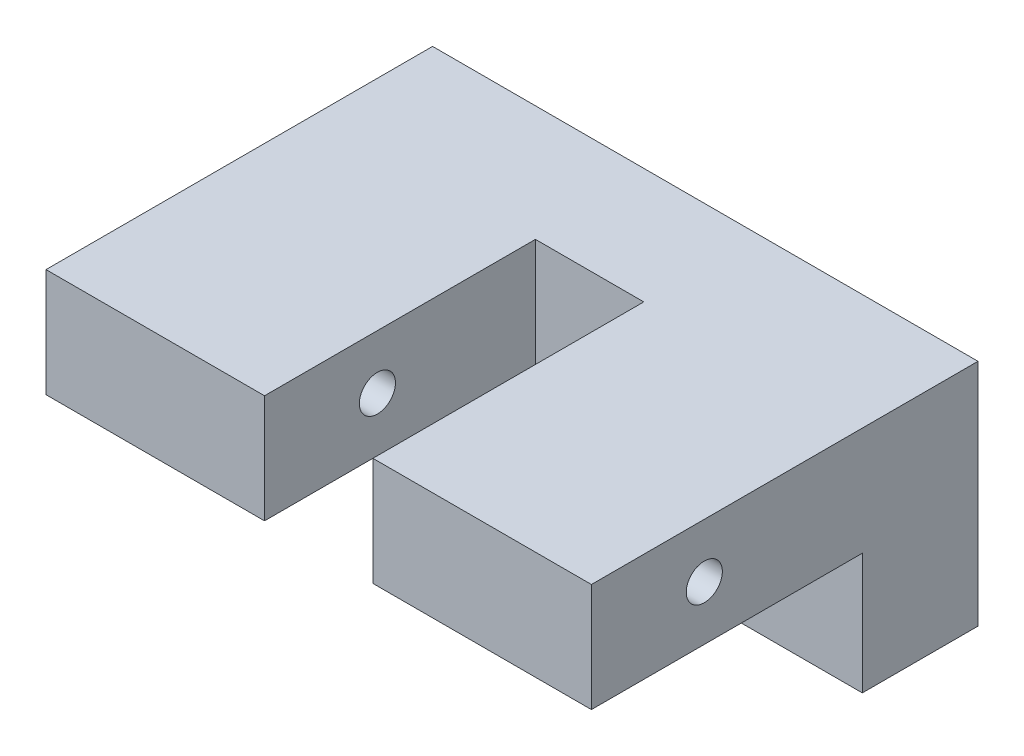
ISO-10303-21;
HEADER;
FILE_DESCRIPTION(('STEP AP214'),'2;1');
FILE_NAME('part.step','',(''),(''),'','','');
FILE_SCHEMA(('AUTOMOTIVE_DESIGN { 1 0 10303 214 1 1 1 1 }'));
ENDSEC;
DATA;
#1=APPLICATION_CONTEXT('core data for automotive mechanical design processes');
#2=APPLICATION_PROTOCOL_DEFINITION('international standard','automotive_design',2000,#1);
#3=PRODUCT_CONTEXT('',#1,'mechanical');
#4=PRODUCT('Part','Part','',(#3));
#5=PRODUCT_RELATED_PRODUCT_CATEGORY('part','',(#4));
#6=PRODUCT_DEFINITION_FORMATION('','',#4);
#7=PRODUCT_DEFINITION_CONTEXT('part definition',#1,'design');
#8=PRODUCT_DEFINITION('design','',#6,#7);
#9=PRODUCT_DEFINITION_SHAPE('','',#8);
#10=(LENGTH_UNIT() NAMED_UNIT(*) SI_UNIT(.MILLI.,.METRE.));
#11=(NAMED_UNIT(*) PLANE_ANGLE_UNIT() SI_UNIT($,.RADIAN.));
#12=(NAMED_UNIT(*) SI_UNIT($,.STERADIAN.) SOLID_ANGLE_UNIT());
#13=UNCERTAINTY_MEASURE_WITH_UNIT(LENGTH_MEASURE(1.E-05),#10,'distance_accuracy_value','');
#14=(GEOMETRIC_REPRESENTATION_CONTEXT(3) GLOBAL_UNCERTAINTY_ASSIGNED_CONTEXT((#13)) GLOBAL_UNIT_ASSIGNED_CONTEXT((#10,
#11,#12)) REPRESENTATION_CONTEXT('',''));
#15=CARTESIAN_POINT('',(0.,0.,0.));
#16=DIRECTION('',(0.,0.,1.));
#17=DIRECTION('',(1.,0.,0.));
#18=AXIS2_PLACEMENT_3D('',#15,#16,#17);
#19=CARTESIAN_POINT('',(0.,0.,85.62));
#20=DIRECTION('',(0.,0.,-1.));
#21=DIRECTION('',(-1.,0.,0.));
#22=AXIS2_PLACEMENT_3D('',#19,#20,#21);
#23=PLANE('',#22);
#24=DIRECTION('',(0.,-1.,0.));
#25=VECTOR('',#24,1.);
#26=CARTESIAN_POINT('',(0.,0.,85.62));
#27=LINE('',#26,#25);
#28=CARTESIAN_POINT('',(0.,50.8,85.62));
#29=VERTEX_POINT('',#28);
#30=CARTESIAN_POINT('',(0.,26.8,85.62));
#31=VERTEX_POINT('',#30);
#32=EDGE_CURVE('E101',#29,#31,#27,.T.);
#33=ORIENTED_EDGE('',*,*,#32,.T.);
#34=DIRECTION('',(1.,0.,0.));
#35=VECTOR('',#34,1.);
#36=CARTESIAN_POINT('',(0.,26.8,85.62));
#37=LINE('',#36,#35);
#38=CARTESIAN_POINT('',(48.4,26.8,85.62));
#39=VERTEX_POINT('',#38);
#40=EDGE_CURVE('E191',#31,#39,#37,.T.);
#41=ORIENTED_EDGE('',*,*,#40,.T.);
#42=DIRECTION('',(0.,-1.,0.));
#43=VECTOR('',#42,1.);
#44=CARTESIAN_POINT('',(48.4,50.8,85.62));
#45=LINE('',#44,#43);
#46=CARTESIAN_POINT('',(48.4,50.8,85.62));
#47=VERTEX_POINT('',#46);
#48=EDGE_CURVE('E185',#47,#39,#45,.T.);
#49=ORIENTED_EDGE('',*,*,#48,.F.);
#50=DIRECTION('',(-1.,0.,0.));
#51=VECTOR('',#50,1.);
#52=CARTESIAN_POINT('',(0.,50.8,85.62));
#53=LINE('',#52,#51);
#54=EDGE_CURVE('E70',#47,#29,#53,.T.);
#55=ORIENTED_EDGE('',*,*,#54,.T.);
#56=EDGE_LOOP('',(#33,#41,#49,#55));
#57=FACE_BOUND('',#56,.T.);
#58=ADVANCED_FACE('F44',(#57),#23,.F.);
#59=CARTESIAN_POINT('',(0.,0.,85.62));
#60=DIRECTION('',(1.,0.,0.));
#61=DIRECTION('',(0.,0.,-1.));
#62=AXIS2_PLACEMENT_3D('',#59,#60,#61);
#63=PLANE('',#62);
#64=CARTESIAN_POINT('',(0.,38.8,60.62));
#65=DIRECTION('',(1.,0.,0.));
#66=DIRECTION('',(0.,0.,-1.));
#67=AXIS2_PLACEMENT_3D('',#64,#65,#66);
#68=CIRCLE('',#67,4.00000000000001);
#69=CARTESIAN_POINT('',(0.,38.8,56.62));
#70=VERTEX_POINT('',#69);
#71=EDGE_CURVE('E228',#70,#70,#68,.T.);
#72=ORIENTED_EDGE('',*,*,#71,.T.);
#73=EDGE_LOOP('',(#72));
#74=FACE_BOUND('',#73,.T.);
#75=DIRECTION('',(0.,1.,0.));
#76=VECTOR('',#75,1.);
#77=CARTESIAN_POINT('',(0.,0.,25.62));
#78=LINE('',#77,#76);
#79=CARTESIAN_POINT('',(0.,0.,25.62));
#80=VERTEX_POINT('',#79);
#81=CARTESIAN_POINT('',(0.,26.8,25.62));
#82=VERTEX_POINT('',#81);
#83=EDGE_CURVE('E150',#80,#82,#78,.T.);
#84=ORIENTED_EDGE('',*,*,#83,.T.);
#85=DIRECTION('',(0.,0.,1.));
#86=VECTOR('',#85,1.);
#87=CARTESIAN_POINT('',(0.,26.8,85.62));
#88=LINE('',#87,#86);
#89=EDGE_CURVE('E250',#82,#31,#88,.T.);
#90=ORIENTED_EDGE('',*,*,#89,.T.);
#91=ORIENTED_EDGE('',*,*,#32,.F.);
#92=DIRECTION('',(0.,0.,-1.));
#93=VECTOR('',#92,1.);
#94=CARTESIAN_POINT('',(0.,50.8,85.62));
#95=LINE('',#94,#93);
#96=CARTESIAN_POINT('',(0.,50.8,0.));
#97=VERTEX_POINT('',#96);
#98=EDGE_CURVE('E92',#29,#97,#95,.T.);
#99=ORIENTED_EDGE('',*,*,#98,.T.);
#100=DIRECTION('',(0.,-1.,0.));
#101=VECTOR('',#100,1.);
#102=CARTESIAN_POINT('',(0.,0.,0.));
#103=LINE('',#102,#101);
#104=CARTESIAN_POINT('',(0.,0.,0.));
#105=VERTEX_POINT('',#104);
#106=EDGE_CURVE('E108',#97,#105,#103,.T.);
#107=ORIENTED_EDGE('',*,*,#106,.T.);
#108=DIRECTION('',(0.,0.,-1.));
#109=VECTOR('',#108,1.);
#110=CARTESIAN_POINT('',(0.,0.,85.62));
#111=LINE('',#110,#109);
#112=EDGE_CURVE('E11',#80,#105,#111,.T.);
#113=ORIENTED_EDGE('',*,*,#112,.F.);
#114=EDGE_LOOP('',(#84,#90,#91,#99,#107,#113));
#115=FACE_BOUND('',#114,.T.);
#116=ADVANCED_FACE('F46',(#74,#115),#63,.F.);
#117=CARTESIAN_POINT('',(0.,0.,85.62));
#118=DIRECTION('',(0.,1.,0.));
#119=DIRECTION('',(0.,0.,1.));
#120=AXIS2_PLACEMENT_3D('',#117,#118,#119);
#121=PLANE('',#120);
#122=DIRECTION('',(0.,0.,-1.));
#123=VECTOR('',#122,1.);
#124=CARTESIAN_POINT('',(120.8,0.,85.62));
#125=LINE('',#124,#123);
#126=CARTESIAN_POINT('',(120.8,0.,25.62));
#127=VERTEX_POINT('',#126);
#128=CARTESIAN_POINT('',(120.8,0.,0.));
#129=VERTEX_POINT('',#128);
#130=EDGE_CURVE('E54',#127,#129,#125,.T.);
#131=ORIENTED_EDGE('',*,*,#130,.F.);
#132=DIRECTION('',(1.,0.,0.));
#133=VECTOR('',#132,1.);
#134=CARTESIAN_POINT('',(48.4,0.,25.62));
#135=LINE('',#134,#133);
#136=EDGE_CURVE('E147',#80,#127,#135,.T.);
#137=ORIENTED_EDGE('',*,*,#136,.F.);
#138=ORIENTED_EDGE('',*,*,#112,.T.);
#139=DIRECTION('',(1.,0.,0.));
#140=VECTOR('',#139,1.);
#141=CARTESIAN_POINT('',(0.,0.,0.));
#142=LINE('',#141,#140);
#143=EDGE_CURVE('E116',#105,#129,#142,.T.);
#144=ORIENTED_EDGE('',*,*,#143,.T.);
#145=EDGE_LOOP('',(#131,#137,#138,#144));
#146=FACE_BOUND('',#145,.T.);
#147=ADVANCED_FACE('F144',(#146),#121,.F.);
#148=CARTESIAN_POINT('',(120.8,0.,85.62));
#149=DIRECTION('',(-1.,0.,0.));
#150=DIRECTION('',(0.,0.,1.));
#151=AXIS2_PLACEMENT_3D('',#148,#149,#150);
#152=PLANE('',#151);
#153=CARTESIAN_POINT('',(120.8,38.8,60.62));
#154=DIRECTION('',(1.,0.,0.));
#155=DIRECTION('',(0.,0.,-1.));
#156=AXIS2_PLACEMENT_3D('',#153,#154,#155);
#157=CIRCLE('',#156,4.00000000000001);
#158=CARTESIAN_POINT('',(120.8,38.8,56.62));
#159=VERTEX_POINT('',#158);
#160=EDGE_CURVE('E224',#159,#159,#157,.T.);
#161=ORIENTED_EDGE('',*,*,#160,.F.);
#162=EDGE_LOOP('',(#161));
#163=FACE_BOUND('',#162,.T.);
#164=DIRECTION('',(0.,1.,0.));
#165=VECTOR('',#164,1.);
#166=CARTESIAN_POINT('',(120.8,0.,85.62));
#167=LINE('',#166,#165);
#168=CARTESIAN_POINT('',(120.8,26.8,85.62));
#169=VERTEX_POINT('',#168);
#170=CARTESIAN_POINT('',(120.8,50.8,85.62));
#171=VERTEX_POINT('',#170);
#172=EDGE_CURVE('E197',#169,#171,#167,.T.);
#173=ORIENTED_EDGE('',*,*,#172,.F.);
#174=DIRECTION('',(0.,0.,1.));
#175=VECTOR('',#174,1.);
#176=CARTESIAN_POINT('',(120.8,26.8,85.62));
#177=LINE('',#176,#175);
#178=CARTESIAN_POINT('',(120.8,26.8,25.62));
#179=VERTEX_POINT('',#178);
#180=EDGE_CURVE('E245',#179,#169,#177,.T.);
#181=ORIENTED_EDGE('',*,*,#180,.F.);
#182=DIRECTION('',(0.,1.,0.));
#183=VECTOR('',#182,1.);
#184=CARTESIAN_POINT('',(120.8,0.,25.62));
#185=LINE('',#184,#183);
#186=EDGE_CURVE('E141',#127,#179,#185,.T.);
#187=ORIENTED_EDGE('',*,*,#186,.F.);
#188=ORIENTED_EDGE('',*,*,#130,.T.);
#189=DIRECTION('',(0.,1.,0.));
#190=VECTOR('',#189,1.);
#191=CARTESIAN_POINT('',(120.8,0.,0.));
#192=LINE('',#191,#190);
#193=CARTESIAN_POINT('',(120.8,50.8,0.));
#194=VERTEX_POINT('',#193);
#195=EDGE_CURVE('E102',#129,#194,#192,.T.);
#196=ORIENTED_EDGE('',*,*,#195,.T.);
#197=DIRECTION('',(0.,0.,-1.));
#198=VECTOR('',#197,1.);
#199=CARTESIAN_POINT('',(120.8,50.8,85.62));
#200=LINE('',#199,#198);
#201=EDGE_CURVE('E96',#171,#194,#200,.T.);
#202=ORIENTED_EDGE('',*,*,#201,.F.);
#203=EDGE_LOOP('',(#173,#181,#187,#188,#196,#202));
#204=FACE_BOUND('',#203,.T.);
#205=ADVANCED_FACE('F138',(#163,#204),#152,.F.);
#206=CARTESIAN_POINT('',(0.,50.8,85.62));
#207=DIRECTION('',(0.,-1.,0.));
#208=DIRECTION('',(0.,0.,-1.));
#209=AXIS2_PLACEMENT_3D('',#206,#207,#208);
#210=PLANE('',#209);
#211=ORIENTED_EDGE('',*,*,#54,.F.);
#212=DIRECTION('',(0.,0.,1.));
#213=VECTOR('',#212,1.);
#214=CARTESIAN_POINT('',(48.4,50.8,25.62));
#215=LINE('',#214,#213);
#216=CARTESIAN_POINT('',(48.4,50.8,25.62));
#217=VERTEX_POINT('',#216);
#218=EDGE_CURVE('E118',#217,#47,#215,.T.);
#219=ORIENTED_EDGE('',*,*,#218,.F.);
#220=DIRECTION('',(-1.,0.,0.));
#221=VECTOR('',#220,1.);
#222=CARTESIAN_POINT('',(48.4,50.8,25.62));
#223=LINE('',#222,#221);
#224=CARTESIAN_POINT('',(72.4,50.8,25.62));
#225=VERTEX_POINT('',#224);
#226=EDGE_CURVE('E208',#225,#217,#223,.T.);
#227=ORIENTED_EDGE('',*,*,#226,.F.);
#228=DIRECTION('',(0.,0.,1.));
#229=VECTOR('',#228,1.);
#230=CARTESIAN_POINT('',(72.4,50.8,25.62));
#231=LINE('',#230,#229);
#232=CARTESIAN_POINT('',(72.4,50.8,85.62));
#233=VERTEX_POINT('',#232);
#234=EDGE_CURVE('E124',#225,#233,#231,.T.);
#235=ORIENTED_EDGE('',*,*,#234,.T.);
#236=EDGE_CURVE('E111',#171,#233,#53,.T.);
#237=ORIENTED_EDGE('',*,*,#236,.F.);
#238=ORIENTED_EDGE('',*,*,#201,.T.);
#239=DIRECTION('',(-1.,0.,0.));
#240=VECTOR('',#239,1.);
#241=CARTESIAN_POINT('',(0.,50.8,0.));
#242=LINE('',#241,#240);
#243=EDGE_CURVE('E89',#194,#97,#242,.T.);
#244=ORIENTED_EDGE('',*,*,#243,.T.);
#245=ORIENTED_EDGE('',*,*,#98,.F.);
#246=EDGE_LOOP('',(#211,#219,#227,#235,#237,#238,#244,#245));
#247=FACE_BOUND('',#246,.T.);
#248=ADVANCED_FACE('F91',(#247),#210,.F.);
#249=DIRECTION('',(0.,1.,0.));
#250=VECTOR('',#249,1.);
#251=CARTESIAN_POINT('',(72.4,50.8,85.62));
#252=LINE('',#251,#250);
#253=CARTESIAN_POINT('',(72.4,26.8,85.62));
#254=VERTEX_POINT('',#253);
#255=EDGE_CURVE('E193',#254,#233,#252,.T.);
#256=ORIENTED_EDGE('',*,*,#255,.F.);
#257=EDGE_CURVE('E242',#254,#169,#37,.T.);
#258=ORIENTED_EDGE('',*,*,#257,.T.);
#259=ORIENTED_EDGE('',*,*,#172,.T.);
#260=ORIENTED_EDGE('',*,*,#236,.T.);
#261=EDGE_LOOP('',(#256,#258,#259,#260));
#262=FACE_BOUND('',#261,.T.);
#263=ADVANCED_FACE('F280',(#262),#23,.F.);
#264=CARTESIAN_POINT('',(0.,0.,0.));
#265=DIRECTION('',(0.,0.,-1.));
#266=DIRECTION('',(-1.,0.,0.));
#267=AXIS2_PLACEMENT_3D('',#264,#265,#266);
#268=PLANE('',#267);
#269=ORIENTED_EDGE('',*,*,#106,.F.);
#270=ORIENTED_EDGE('',*,*,#243,.F.);
#271=ORIENTED_EDGE('',*,*,#195,.F.);
#272=ORIENTED_EDGE('',*,*,#143,.F.);
#273=EDGE_LOOP('',(#269,#270,#271,#272));
#274=FACE_BOUND('',#273,.T.);
#275=ADVANCED_FACE('F114',(#274),#268,.T.);
#276=CARTESIAN_POINT('',(48.4,50.8,25.62));
#277=DIRECTION('',(-1.,0.,0.));
#278=DIRECTION('',(0.,-1.,0.));
#279=AXIS2_PLACEMENT_3D('',#276,#277,#278);
#280=PLANE('',#279);
#281=CARTESIAN_POINT('',(48.4,38.8,60.62));
#282=DIRECTION('',(-1.,0.,0.));
#283=DIRECTION('',(0.,-1.,0.));
#284=AXIS2_PLACEMENT_3D('',#281,#282,#283);
#285=CIRCLE('',#284,4.00000000000001);
#286=CARTESIAN_POINT('',(48.4,34.8,60.62));
#287=VERTEX_POINT('',#286);
#288=EDGE_CURVE('E194',#287,#287,#285,.T.);
#289=ORIENTED_EDGE('',*,*,#288,.T.);
#290=EDGE_LOOP('',(#289));
#291=FACE_BOUND('',#290,.T.);
#292=ORIENTED_EDGE('',*,*,#48,.T.);
#293=DIRECTION('',(0.,0.,-1.));
#294=VECTOR('',#293,1.);
#295=CARTESIAN_POINT('',(48.4,26.8,25.62));
#296=LINE('',#295,#294);
#297=CARTESIAN_POINT('',(48.4,26.8,25.62));
#298=VERTEX_POINT('',#297);
#299=EDGE_CURVE('E229',#39,#298,#296,.T.);
#300=ORIENTED_EDGE('',*,*,#299,.T.);
#301=DIRECTION('',(0.,-1.,0.));
#302=VECTOR('',#301,1.);
#303=CARTESIAN_POINT('',(48.4,50.8,25.62));
#304=LINE('',#303,#302);
#305=EDGE_CURVE('E187',#217,#298,#304,.T.);
#306=ORIENTED_EDGE('',*,*,#305,.F.);
#307=ORIENTED_EDGE('',*,*,#218,.T.);
#308=EDGE_LOOP('',(#292,#300,#306,#307));
#309=FACE_BOUND('',#308,.T.);
#310=ADVANCED_FACE('F183',(#291,#309),#280,.F.);
#311=CARTESIAN_POINT('',(72.4,50.8,25.62));
#312=DIRECTION('',(1.,0.,0.));
#313=DIRECTION('',(0.,1.,0.));
#314=AXIS2_PLACEMENT_3D('',#311,#312,#313);
#315=PLANE('',#314);
#316=CARTESIAN_POINT('',(72.4,38.8,60.62));
#317=DIRECTION('',(1.,0.,0.));
#318=DIRECTION('',(0.,1.,0.));
#319=AXIS2_PLACEMENT_3D('',#316,#317,#318);
#320=CIRCLE('',#319,4.00000000000001);
#321=CARTESIAN_POINT('',(72.4,42.8,60.62));
#322=VERTEX_POINT('',#321);
#323=EDGE_CURVE('E48',#322,#322,#320,.T.);
#324=ORIENTED_EDGE('',*,*,#323,.T.);
#325=EDGE_LOOP('',(#324));
#326=FACE_BOUND('',#325,.T.);
#327=DIRECTION('',(0.,1.,0.));
#328=VECTOR('',#327,1.);
#329=CARTESIAN_POINT('',(72.4,50.8,25.62));
#330=LINE('',#329,#328);
#331=CARTESIAN_POINT('',(72.4,26.8,25.62));
#332=VERTEX_POINT('',#331);
#333=EDGE_CURVE('E214',#332,#225,#330,.T.);
#334=ORIENTED_EDGE('',*,*,#333,.F.);
#335=DIRECTION('',(0.,0.,1.));
#336=VECTOR('',#335,1.);
#337=CARTESIAN_POINT('',(72.4,26.8,25.62));
#338=LINE('',#337,#336);
#339=EDGE_CURVE('E235',#332,#254,#338,.T.);
#340=ORIENTED_EDGE('',*,*,#339,.T.);
#341=ORIENTED_EDGE('',*,*,#255,.T.);
#342=ORIENTED_EDGE('',*,*,#234,.F.);
#343=EDGE_LOOP('',(#334,#340,#341,#342));
#344=FACE_BOUND('',#343,.T.);
#345=ADVANCED_FACE('F260',(#326,#344),#315,.F.);
#346=CARTESIAN_POINT('',(0.,0.,25.62));
#347=DIRECTION('',(0.,0.,1.));
#348=DIRECTION('',(1.,0.,0.));
#349=AXIS2_PLACEMENT_3D('',#346,#347,#348);
#350=PLANE('',#349);
#351=ORIENTED_EDGE('',*,*,#305,.T.);
#352=DIRECTION('',(1.,0.,0.));
#353=VECTOR('',#352,1.);
#354=CARTESIAN_POINT('',(0.,26.8,25.62));
#355=LINE('',#354,#353);
#356=EDGE_CURVE('E239',#82,#298,#355,.T.);
#357=ORIENTED_EDGE('',*,*,#356,.F.);
#358=ORIENTED_EDGE('',*,*,#83,.F.);
#359=ORIENTED_EDGE('',*,*,#136,.T.);
#360=ORIENTED_EDGE('',*,*,#186,.T.);
#361=EDGE_CURVE('E61',#332,#179,#355,.T.);
#362=ORIENTED_EDGE('',*,*,#361,.F.);
#363=ORIENTED_EDGE('',*,*,#333,.T.);
#364=ORIENTED_EDGE('',*,*,#226,.T.);
#365=EDGE_LOOP('',(#351,#357,#358,#359,#360,#362,#363,#364));
#366=FACE_BOUND('',#365,.T.);
#367=ADVANCED_FACE('F266',(#366),#350,.T.);
#368=CARTESIAN_POINT('',(0.,38.8,60.62));
#369=DIRECTION('',(1.,0.,0.));
#370=DIRECTION('',(0.,0.,-1.));
#371=AXIS2_PLACEMENT_3D('',#368,#369,#370);
#372=CYLINDRICAL_SURFACE('',#371,4.00000000000001);
#373=ORIENTED_EDGE('',*,*,#160,.T.);
#374=EDGE_LOOP('',(#373));
#375=FACE_BOUND('',#374,.T.);
#376=ORIENTED_EDGE('',*,*,#323,.F.);
#377=EDGE_LOOP('',(#376));
#378=FACE_BOUND('',#377,.T.);
#379=ADVANCED_FACE('F263',(#375,#378),#372,.F.);
#380=ORIENTED_EDGE('',*,*,#71,.F.);
#381=EDGE_LOOP('',(#380));
#382=FACE_BOUND('',#381,.T.);
#383=ORIENTED_EDGE('',*,*,#288,.F.);
#384=EDGE_LOOP('',(#383));
#385=FACE_BOUND('',#384,.T.);
#386=ADVANCED_FACE('F265',(#382,#385),#372,.F.);
#387=CARTESIAN_POINT('',(0.,26.8,85.62));
#388=DIRECTION('',(0.,1.,0.));
#389=DIRECTION('',(0.,0.,1.));
#390=AXIS2_PLACEMENT_3D('',#387,#388,#389);
#391=PLANE('',#390);
#392=ORIENTED_EDGE('',*,*,#361,.T.);
#393=ORIENTED_EDGE('',*,*,#180,.T.);
#394=ORIENTED_EDGE('',*,*,#257,.F.);
#395=ORIENTED_EDGE('',*,*,#339,.F.);
#396=EDGE_LOOP('',(#392,#393,#394,#395));
#397=FACE_BOUND('',#396,.T.);
#398=ADVANCED_FACE('F273',(#397),#391,.F.);
#399=ORIENTED_EDGE('',*,*,#40,.F.);
#400=ORIENTED_EDGE('',*,*,#89,.F.);
#401=ORIENTED_EDGE('',*,*,#356,.T.);
#402=ORIENTED_EDGE('',*,*,#299,.F.);
#403=EDGE_LOOP('',(#399,#400,#401,#402));
#404=FACE_BOUND('',#403,.T.);
#405=ADVANCED_FACE('F299',(#404),#391,.F.);
#406=CLOSED_SHELL('',(#58,#116,#147,#205,#248,#263,#275,#310,#345,#367,#379,#386,#398,#405));
#407=MANIFOLD_SOLID_BREP('B2',#406);
#408=ADVANCED_BREP_SHAPE_REPRESENTATION('',(#18,#407),#14);
#409=SHAPE_DEFINITION_REPRESENTATION(#9,#408);
ENDSEC;
END-ISO-10303-21;
